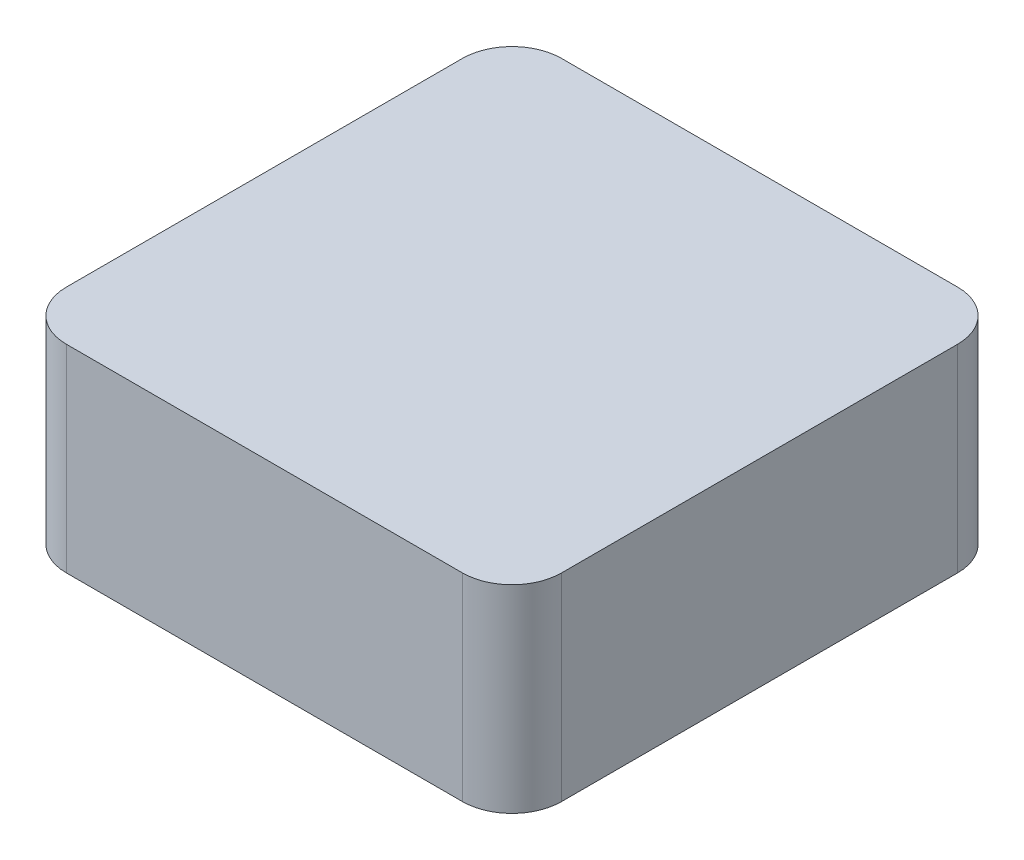
ISO-10303-21;
HEADER;
FILE_DESCRIPTION(('STEP AP214'),'2;1');
FILE_NAME('part.step','',(''),(''),'','','');
FILE_SCHEMA(('AUTOMOTIVE_DESIGN { 1 0 10303 214 1 1 1 1 }'));
ENDSEC;
DATA;
#1=APPLICATION_CONTEXT('core data for automotive mechanical design processes');
#2=APPLICATION_PROTOCOL_DEFINITION('international standard','automotive_design',2000,#1);
#3=PRODUCT_CONTEXT('',#1,'mechanical');
#4=PRODUCT('Part','Part','',(#3));
#5=PRODUCT_RELATED_PRODUCT_CATEGORY('part','',(#4));
#6=PRODUCT_DEFINITION_FORMATION('','',#4);
#7=PRODUCT_DEFINITION_CONTEXT('part definition',#1,'design');
#8=PRODUCT_DEFINITION('design','',#6,#7);
#9=PRODUCT_DEFINITION_SHAPE('','',#8);
#10=(LENGTH_UNIT() NAMED_UNIT(*) SI_UNIT(.MILLI.,.METRE.));
#11=(NAMED_UNIT(*) PLANE_ANGLE_UNIT() SI_UNIT($,.RADIAN.));
#12=(NAMED_UNIT(*) SI_UNIT($,.STERADIAN.) SOLID_ANGLE_UNIT());
#13=UNCERTAINTY_MEASURE_WITH_UNIT(LENGTH_MEASURE(1.E-05),#10,'distance_accuracy_value','');
#14=(GEOMETRIC_REPRESENTATION_CONTEXT(3) GLOBAL_UNCERTAINTY_ASSIGNED_CONTEXT((#13)) GLOBAL_UNIT_ASSIGNED_CONTEXT((#10,
#11,#12)) REPRESENTATION_CONTEXT('',''));
#15=CARTESIAN_POINT('',(0.,0.,0.));
#16=DIRECTION('',(0.,0.,1.));
#17=DIRECTION('',(1.,0.,0.));
#18=AXIS2_PLACEMENT_3D('',#15,#16,#17);
#19=CARTESIAN_POINT('',(0.,0.2,0.));
#20=DIRECTION('',(1.,0.,0.));
#21=DIRECTION('',(0.,0.,-1.));
#22=AXIS2_PLACEMENT_3D('',#19,#20,#21);
#23=PLANE('',#22);
#24=DIRECTION('',(0.,0.,1.));
#25=VECTOR('',#24,1.);
#26=CARTESIAN_POINT('',(0.,0.,0.));
#27=LINE('',#26,#25);
#28=CARTESIAN_POINT('',(0.,0.,0.05));
#29=VERTEX_POINT('',#28);
#30=CARTESIAN_POINT('',(0.,0.,0.45));
#31=VERTEX_POINT('',#30);
#32=EDGE_CURVE('E130',#29,#31,#27,.T.);
#33=ORIENTED_EDGE('',*,*,#32,.T.);
#34=DIRECTION('',(0.,-1.,0.));
#35=VECTOR('',#34,1.);
#36=CARTESIAN_POINT('',(0.,0.2,0.45));
#37=LINE('',#36,#35);
#38=CARTESIAN_POINT('',(0.,0.2,0.45));
#39=VERTEX_POINT('',#38);
#40=EDGE_CURVE('E108',#31,#39,#37,.F.);
#41=ORIENTED_EDGE('',*,*,#40,.T.);
#42=DIRECTION('',(0.,0.,1.));
#43=VECTOR('',#42,1.);
#44=CARTESIAN_POINT('',(0.,0.2,0.));
#45=LINE('',#44,#43);
#46=CARTESIAN_POINT('',(0.,0.2,0.05));
#47=VERTEX_POINT('',#46);
#48=EDGE_CURVE('E139',#47,#39,#45,.T.);
#49=ORIENTED_EDGE('',*,*,#48,.F.);
#50=DIRECTION('',(0.,-1.,0.));
#51=VECTOR('',#50,1.);
#52=CARTESIAN_POINT('',(0.,0.2,0.05));
#53=LINE('',#52,#51);
#54=EDGE_CURVE('E113',#47,#29,#53,.T.);
#55=ORIENTED_EDGE('',*,*,#54,.T.);
#56=EDGE_LOOP('',(#33,#41,#49,#55));
#57=FACE_BOUND('',#56,.T.);
#58=ADVANCED_FACE('F38',(#57),#23,.F.);
#59=CARTESIAN_POINT('',(0.,0.2,0.5));
#60=DIRECTION('',(0.,0.,-1.));
#61=DIRECTION('',(-1.,0.,0.));
#62=AXIS2_PLACEMENT_3D('',#59,#60,#61);
#63=PLANE('',#62);
#64=DIRECTION('',(1.,0.,0.));
#65=VECTOR('',#64,1.);
#66=CARTESIAN_POINT('',(0.,0.2,0.5));
#67=LINE('',#66,#65);
#68=CARTESIAN_POINT('',(0.0500000000000002,0.2,0.5));
#69=VERTEX_POINT('',#68);
#70=CARTESIAN_POINT('',(0.45,0.2,0.5));
#71=VERTEX_POINT('',#70);
#72=EDGE_CURVE('E123',#69,#71,#67,.T.);
#73=ORIENTED_EDGE('',*,*,#72,.F.);
#74=DIRECTION('',(0.,-1.,0.));
#75=VECTOR('',#74,1.);
#76=CARTESIAN_POINT('',(0.0500000000000002,0.2,0.5));
#77=LINE('',#76,#75);
#78=CARTESIAN_POINT('',(0.0500000000000002,0.,0.5));
#79=VERTEX_POINT('',#78);
#80=EDGE_CURVE('E107',#69,#79,#77,.T.);
#81=ORIENTED_EDGE('',*,*,#80,.T.);
#82=DIRECTION('',(1.,0.,0.));
#83=VECTOR('',#82,1.);
#84=CARTESIAN_POINT('',(0.,0.,0.5));
#85=LINE('',#84,#83);
#86=CARTESIAN_POINT('',(0.45,0.,0.5));
#87=VERTEX_POINT('',#86);
#88=EDGE_CURVE('E120',#79,#87,#85,.T.);
#89=ORIENTED_EDGE('',*,*,#88,.T.);
#90=DIRECTION('',(0.,-1.,0.));
#91=VECTOR('',#90,1.);
#92=CARTESIAN_POINT('',(0.45,0.2,0.5));
#93=LINE('',#92,#91);
#94=EDGE_CURVE('E125',#87,#71,#93,.F.);
#95=ORIENTED_EDGE('',*,*,#94,.T.);
#96=EDGE_LOOP('',(#73,#81,#89,#95));
#97=FACE_BOUND('',#96,.T.);
#98=ADVANCED_FACE('F119',(#97),#63,.F.);
#99=CARTESIAN_POINT('',(0.5,0.2,0.));
#100=DIRECTION('',(-1.,0.,0.));
#101=DIRECTION('',(0.,0.,1.));
#102=AXIS2_PLACEMENT_3D('',#99,#100,#101);
#103=PLANE('',#102);
#104=DIRECTION('',(0.,0.,-1.));
#105=VECTOR('',#104,1.);
#106=CARTESIAN_POINT('',(0.5,0.2,0.));
#107=LINE('',#106,#105);
#108=CARTESIAN_POINT('',(0.5,0.2,0.45));
#109=VERTEX_POINT('',#108);
#110=CARTESIAN_POINT('',(0.5,0.2,0.05));
#111=VERTEX_POINT('',#110);
#112=EDGE_CURVE('E173',#109,#111,#107,.T.);
#113=ORIENTED_EDGE('',*,*,#112,.F.);
#114=DIRECTION('',(0.,-1.,0.));
#115=VECTOR('',#114,1.);
#116=CARTESIAN_POINT('',(0.5,0.2,0.45));
#117=LINE('',#116,#115);
#118=CARTESIAN_POINT('',(0.5,0.,0.45));
#119=VERTEX_POINT('',#118);
#120=EDGE_CURVE('E158',#109,#119,#117,.T.);
#121=ORIENTED_EDGE('',*,*,#120,.T.);
#122=DIRECTION('',(0.,0.,-1.));
#123=VECTOR('',#122,1.);
#124=CARTESIAN_POINT('',(0.5,0.,0.));
#125=LINE('',#124,#123);
#126=CARTESIAN_POINT('',(0.5,0.,0.05));
#127=VERTEX_POINT('',#126);
#128=EDGE_CURVE('E129',#119,#127,#125,.T.);
#129=ORIENTED_EDGE('',*,*,#128,.T.);
#130=DIRECTION('',(0.,-1.,0.));
#131=VECTOR('',#130,1.);
#132=CARTESIAN_POINT('',(0.5,0.2,0.05));
#133=LINE('',#132,#131);
#134=EDGE_CURVE('E156',#127,#111,#133,.F.);
#135=ORIENTED_EDGE('',*,*,#134,.T.);
#136=EDGE_LOOP('',(#113,#121,#129,#135));
#137=FACE_BOUND('',#136,.T.);
#138=ADVANCED_FACE('F184',(#137),#103,.F.);
#139=CARTESIAN_POINT('',(0.,0.2,0.));
#140=DIRECTION('',(0.,0.,1.));
#141=DIRECTION('',(1.,0.,0.));
#142=AXIS2_PLACEMENT_3D('',#139,#140,#141);
#143=PLANE('',#142);
#144=DIRECTION('',(-1.,0.,0.));
#145=VECTOR('',#144,1.);
#146=CARTESIAN_POINT('',(0.,0.,0.));
#147=LINE('',#146,#145);
#148=CARTESIAN_POINT('',(0.45,0.,0.));
#149=VERTEX_POINT('',#148);
#150=CARTESIAN_POINT('',(0.05,0.,0.));
#151=VERTEX_POINT('',#150);
#152=EDGE_CURVE('E133',#149,#151,#147,.T.);
#153=ORIENTED_EDGE('',*,*,#152,.T.);
#154=DIRECTION('',(0.,-1.,0.));
#155=VECTOR('',#154,1.);
#156=CARTESIAN_POINT('',(0.05,0.2,0.));
#157=LINE('',#156,#155);
#158=CARTESIAN_POINT('',(0.05,0.2,0.));
#159=VERTEX_POINT('',#158);
#160=EDGE_CURVE('E11',#151,#159,#157,.F.);
#161=ORIENTED_EDGE('',*,*,#160,.T.);
#162=DIRECTION('',(-1.,0.,0.));
#163=VECTOR('',#162,1.);
#164=CARTESIAN_POINT('',(0.,0.2,0.));
#165=LINE('',#164,#163);
#166=CARTESIAN_POINT('',(0.45,0.2,0.));
#167=VERTEX_POINT('',#166);
#168=EDGE_CURVE('E140',#167,#159,#165,.T.);
#169=ORIENTED_EDGE('',*,*,#168,.F.);
#170=DIRECTION('',(0.,-1.,0.));
#171=VECTOR('',#170,1.);
#172=CARTESIAN_POINT('',(0.45,0.2,0.));
#173=LINE('',#172,#171);
#174=EDGE_CURVE('E46',#167,#149,#173,.T.);
#175=ORIENTED_EDGE('',*,*,#174,.T.);
#176=EDGE_LOOP('',(#153,#161,#169,#175));
#177=FACE_BOUND('',#176,.T.);
#178=ADVANCED_FACE('F163',(#177),#143,.F.);
#179=CARTESIAN_POINT('',(0.,0.2,0.));
#180=DIRECTION('',(0.,1.,0.));
#181=DIRECTION('',(0.,0.,1.));
#182=AXIS2_PLACEMENT_3D('',#179,#180,#181);
#183=PLANE('',#182);
#184=ORIENTED_EDGE('',*,*,#48,.T.);
#185=CARTESIAN_POINT('',(0.0500000000000002,0.2,0.45));
#186=DIRECTION('',(0.,1.,0.));
#187=DIRECTION('',(0.,0.,1.));
#188=AXIS2_PLACEMENT_3D('',#185,#186,#187);
#189=CIRCLE('',#188,0.05);
#190=EDGE_CURVE('E154',#39,#69,#189,.T.);
#191=ORIENTED_EDGE('',*,*,#190,.T.);
#192=ORIENTED_EDGE('',*,*,#72,.T.);
#193=CARTESIAN_POINT('',(0.45,0.2,0.45));
#194=DIRECTION('',(0.,1.,0.));
#195=DIRECTION('',(0.,0.,1.));
#196=AXIS2_PLACEMENT_3D('',#193,#194,#195);
#197=CIRCLE('',#196,0.05);
#198=EDGE_CURVE('E152',#71,#109,#197,.T.);
#199=ORIENTED_EDGE('',*,*,#198,.T.);
#200=ORIENTED_EDGE('',*,*,#112,.T.);
#201=CARTESIAN_POINT('',(0.45,0.2,0.05));
#202=DIRECTION('',(0.,1.,0.));
#203=DIRECTION('',(0.,0.,1.));
#204=AXIS2_PLACEMENT_3D('',#201,#202,#203);
#205=CIRCLE('',#204,0.05);
#206=EDGE_CURVE('E58',#111,#167,#205,.T.);
#207=ORIENTED_EDGE('',*,*,#206,.T.);
#208=ORIENTED_EDGE('',*,*,#168,.T.);
#209=CARTESIAN_POINT('',(0.05,0.2,0.05));
#210=DIRECTION('',(0.,1.,0.));
#211=DIRECTION('',(0.,0.,1.));
#212=AXIS2_PLACEMENT_3D('',#209,#210,#211);
#213=CIRCLE('',#212,0.05);
#214=EDGE_CURVE('E150',#159,#47,#213,.T.);
#215=ORIENTED_EDGE('',*,*,#214,.T.);
#216=EDGE_LOOP('',(#184,#191,#192,#199,#200,#207,#208,#215));
#217=FACE_BOUND('',#216,.T.);
#218=ADVANCED_FACE('F176',(#217),#183,.T.);
#219=CARTESIAN_POINT('',(0.,0.,0.));
#220=DIRECTION('',(0.,1.,0.));
#221=DIRECTION('',(0.,0.,1.));
#222=AXIS2_PLACEMENT_3D('',#219,#220,#221);
#223=PLANE('',#222);
#224=ORIENTED_EDGE('',*,*,#88,.F.);
#225=CARTESIAN_POINT('',(0.0500000000000002,0.,0.45));
#226=DIRECTION('',(0.,1.,0.));
#227=DIRECTION('',(0.,0.,1.));
#228=AXIS2_PLACEMENT_3D('',#225,#226,#227);
#229=CIRCLE('',#228,0.05);
#230=EDGE_CURVE('E103',#79,#31,#229,.F.);
#231=ORIENTED_EDGE('',*,*,#230,.T.);
#232=ORIENTED_EDGE('',*,*,#32,.F.);
#233=CARTESIAN_POINT('',(0.05,0.,0.05));
#234=DIRECTION('',(0.,1.,0.));
#235=DIRECTION('',(0.,0.,1.));
#236=AXIS2_PLACEMENT_3D('',#233,#234,#235);
#237=CIRCLE('',#236,0.05);
#238=EDGE_CURVE('E143',#29,#151,#237,.F.);
#239=ORIENTED_EDGE('',*,*,#238,.T.);
#240=ORIENTED_EDGE('',*,*,#152,.F.);
#241=CARTESIAN_POINT('',(0.45,0.,0.05));
#242=DIRECTION('',(0.,1.,0.));
#243=DIRECTION('',(0.,0.,1.));
#244=AXIS2_PLACEMENT_3D('',#241,#242,#243);
#245=CIRCLE('',#244,0.05);
#246=EDGE_CURVE('E124',#149,#127,#245,.F.);
#247=ORIENTED_EDGE('',*,*,#246,.T.);
#248=ORIENTED_EDGE('',*,*,#128,.F.);
#249=CARTESIAN_POINT('',(0.45,0.,0.45));
#250=DIRECTION('',(0.,1.,0.));
#251=DIRECTION('',(0.,0.,1.));
#252=AXIS2_PLACEMENT_3D('',#249,#250,#251);
#253=CIRCLE('',#252,0.05);
#254=EDGE_CURVE('E114',#119,#87,#253,.F.);
#255=ORIENTED_EDGE('',*,*,#254,.T.);
#256=EDGE_LOOP('',(#224,#231,#232,#239,#240,#247,#248,#255));
#257=FACE_BOUND('',#256,.T.);
#258=ADVANCED_FACE('F127',(#257),#223,.F.);
#259=CARTESIAN_POINT('',(0.0500000000000002,0.2,0.45));
#260=DIRECTION('',(0.,-1.,0.));
#261=DIRECTION('',(0.,0.,-1.));
#262=AXIS2_PLACEMENT_3D('',#259,#260,#261);
#263=CYLINDRICAL_SURFACE('',#262,0.05);
#264=ORIENTED_EDGE('',*,*,#190,.F.);
#265=ORIENTED_EDGE('',*,*,#40,.F.);
#266=ORIENTED_EDGE('',*,*,#230,.F.);
#267=ORIENTED_EDGE('',*,*,#80,.F.);
#268=EDGE_LOOP('',(#264,#265,#266,#267));
#269=FACE_BOUND('',#268,.T.);
#270=ADVANCED_FACE('F106',(#269),#263,.T.);
#271=CARTESIAN_POINT('',(0.45,0.2,0.45));
#272=DIRECTION('',(0.,-1.,0.));
#273=DIRECTION('',(0.,0.,-1.));
#274=AXIS2_PLACEMENT_3D('',#271,#272,#273);
#275=CYLINDRICAL_SURFACE('',#274,0.05);
#276=ORIENTED_EDGE('',*,*,#198,.F.);
#277=ORIENTED_EDGE('',*,*,#94,.F.);
#278=ORIENTED_EDGE('',*,*,#254,.F.);
#279=ORIENTED_EDGE('',*,*,#120,.F.);
#280=EDGE_LOOP('',(#276,#277,#278,#279));
#281=FACE_BOUND('',#280,.T.);
#282=ADVANCED_FACE('F196',(#281),#275,.T.);
#283=CARTESIAN_POINT('',(0.05,0.2,0.05));
#284=DIRECTION('',(0.,-1.,0.));
#285=DIRECTION('',(0.,0.,-1.));
#286=AXIS2_PLACEMENT_3D('',#283,#284,#285);
#287=CYLINDRICAL_SURFACE('',#286,0.05);
#288=ORIENTED_EDGE('',*,*,#214,.F.);
#289=ORIENTED_EDGE('',*,*,#160,.F.);
#290=ORIENTED_EDGE('',*,*,#238,.F.);
#291=ORIENTED_EDGE('',*,*,#54,.F.);
#292=EDGE_LOOP('',(#288,#289,#290,#291));
#293=FACE_BOUND('',#292,.T.);
#294=ADVANCED_FACE('F168',(#293),#287,.T.);
#295=CARTESIAN_POINT('',(0.45,0.2,0.05));
#296=DIRECTION('',(0.,-1.,0.));
#297=DIRECTION('',(0.,0.,-1.));
#298=AXIS2_PLACEMENT_3D('',#295,#296,#297);
#299=CYLINDRICAL_SURFACE('',#298,0.05);
#300=ORIENTED_EDGE('',*,*,#206,.F.);
#301=ORIENTED_EDGE('',*,*,#134,.F.);
#302=ORIENTED_EDGE('',*,*,#246,.F.);
#303=ORIENTED_EDGE('',*,*,#174,.F.);
#304=EDGE_LOOP('',(#300,#301,#302,#303));
#305=FACE_BOUND('',#304,.T.);
#306=ADVANCED_FACE('F40',(#305),#299,.T.);
#307=CLOSED_SHELL('',(#58,#98,#138,#178,#218,#258,#270,#282,#294,#306));
#308=MANIFOLD_SOLID_BREP('B2',#307);
#309=ADVANCED_BREP_SHAPE_REPRESENTATION('',(#18,#308),#14);
#310=SHAPE_DEFINITION_REPRESENTATION(#9,#309);
ENDSEC;
END-ISO-10303-21;
